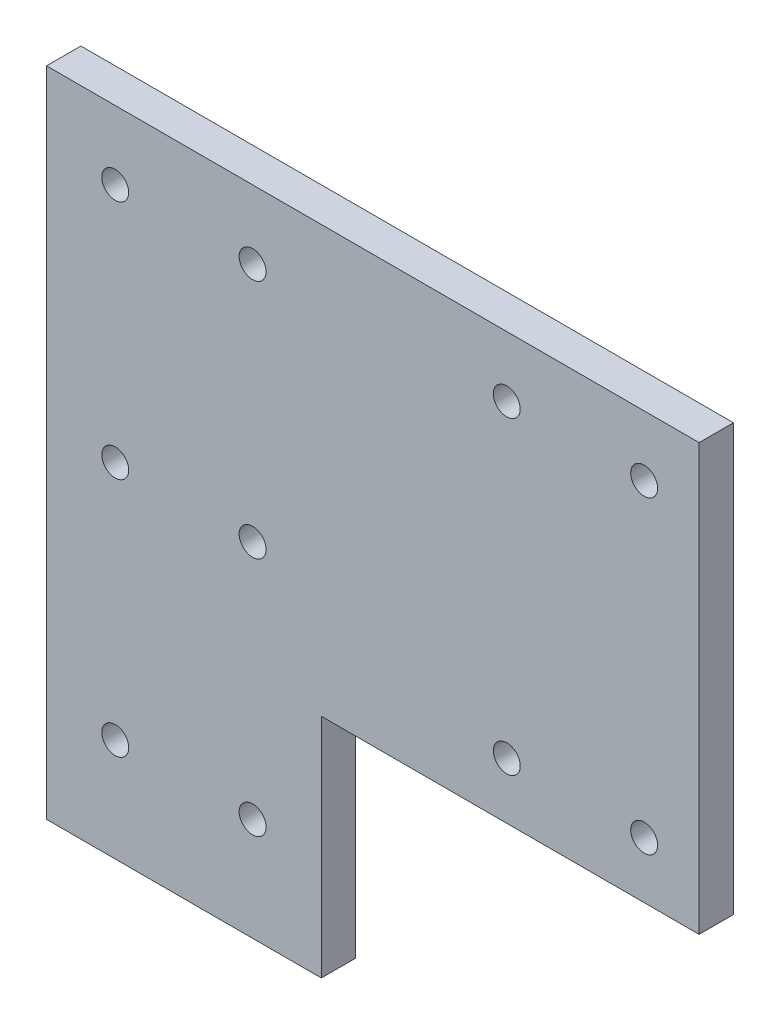
ISO-10303-21;
HEADER;
FILE_DESCRIPTION(('STEP AP214'),'2;1');
FILE_NAME('part.step','',(''),(''),'','','');
FILE_SCHEMA(('AUTOMOTIVE_DESIGN { 1 0 10303 214 1 1 1 1 }'));
ENDSEC;
DATA;
#1=APPLICATION_CONTEXT('core data for automotive mechanical design processes');
#2=APPLICATION_PROTOCOL_DEFINITION('international standard','automotive_design',2000,#1);
#3=PRODUCT_CONTEXT('',#1,'mechanical');
#4=PRODUCT('Part','Part','',(#3));
#5=PRODUCT_RELATED_PRODUCT_CATEGORY('part','',(#4));
#6=PRODUCT_DEFINITION_FORMATION('','',#4);
#7=PRODUCT_DEFINITION_CONTEXT('part definition',#1,'design');
#8=PRODUCT_DEFINITION('design','',#6,#7);
#9=PRODUCT_DEFINITION_SHAPE('','',#8);
#10=(LENGTH_UNIT() NAMED_UNIT(*) SI_UNIT(.MILLI.,.METRE.));
#11=(NAMED_UNIT(*) PLANE_ANGLE_UNIT() SI_UNIT($,.RADIAN.));
#12=(NAMED_UNIT(*) SI_UNIT($,.STERADIAN.) SOLID_ANGLE_UNIT());
#13=UNCERTAINTY_MEASURE_WITH_UNIT(LENGTH_MEASURE(1.E-05),#10,'distance_accuracy_value','');
#14=(GEOMETRIC_REPRESENTATION_CONTEXT(3) GLOBAL_UNCERTAINTY_ASSIGNED_CONTEXT((#13)) GLOBAL_UNIT_ASSIGNED_CONTEXT((#10,
#11,#12)) REPRESENTATION_CONTEXT('',''));
#15=CARTESIAN_POINT('',(0.,0.,0.));
#16=DIRECTION('',(0.,0.,1.));
#17=DIRECTION('',(1.,0.,0.));
#18=AXIS2_PLACEMENT_3D('',#15,#16,#17);
#19=CARTESIAN_POINT('',(50.8,0.,6.35));
#20=DIRECTION('',(0.,1.,0.));
#21=DIRECTION('',(-1.,0.,0.));
#22=AXIS2_PLACEMENT_3D('',#19,#20,#21);
#23=PLANE('',#22);
#24=DIRECTION('',(1.,0.,0.));
#25=VECTOR('',#24,1.);
#26=CARTESIAN_POINT('',(50.8,0.,0.));
#27=LINE('',#26,#25);
#28=CARTESIAN_POINT('',(0.,0.,0.));
#29=VERTEX_POINT('',#28);
#30=CARTESIAN_POINT('',(50.8,0.,0.));
#31=VERTEX_POINT('',#30);
#32=EDGE_CURVE('E116',#29,#31,#27,.T.);
#33=ORIENTED_EDGE('',*,*,#32,.T.);
#34=DIRECTION('',(0.,0.,-1.));
#35=VECTOR('',#34,1.);
#36=CARTESIAN_POINT('',(50.8,0.,6.35));
#37=LINE('',#36,#35);
#38=CARTESIAN_POINT('',(50.8,0.,6.35));
#39=VERTEX_POINT('',#38);
#40=EDGE_CURVE('E11',#39,#31,#37,.T.);
#41=ORIENTED_EDGE('',*,*,#40,.F.);
#42=DIRECTION('',(1.,0.,0.));
#43=VECTOR('',#42,1.);
#44=CARTESIAN_POINT('',(50.8,0.,6.35));
#45=LINE('',#44,#43);
#46=CARTESIAN_POINT('',(0.,0.,6.35));
#47=VERTEX_POINT('',#46);
#48=EDGE_CURVE('E127',#47,#39,#45,.T.);
#49=ORIENTED_EDGE('',*,*,#48,.F.);
#50=DIRECTION('',(0.,0.,-1.));
#51=VECTOR('',#50,1.);
#52=CARTESIAN_POINT('',(0.,0.,6.35));
#53=LINE('',#52,#51);
#54=EDGE_CURVE('E112',#47,#29,#53,.T.);
#55=ORIENTED_EDGE('',*,*,#54,.T.);
#56=EDGE_LOOP('',(#33,#41,#49,#55));
#57=FACE_BOUND('',#56,.T.);
#58=ADVANCED_FACE('F32',(#57),#23,.F.);
#59=CARTESIAN_POINT('',(50.8,41.91,6.35));
#60=DIRECTION('',(-1.,0.,0.));
#61=DIRECTION('',(0.,0.,1.));
#62=AXIS2_PLACEMENT_3D('',#59,#60,#61);
#63=PLANE('',#62);
#64=DIRECTION('',(0.,1.,0.));
#65=VECTOR('',#64,1.);
#66=CARTESIAN_POINT('',(50.8,41.91,0.));
#67=LINE('',#66,#65);
#68=CARTESIAN_POINT('',(50.8,41.91,0.));
#69=VERTEX_POINT('',#68);
#70=EDGE_CURVE('E119',#31,#69,#67,.T.);
#71=ORIENTED_EDGE('',*,*,#70,.T.);
#72=DIRECTION('',(0.,0.,-1.));
#73=VECTOR('',#72,1.);
#74=CARTESIAN_POINT('',(50.8,41.91,6.35));
#75=LINE('',#74,#73);
#76=CARTESIAN_POINT('',(50.8,41.91,6.35));
#77=VERTEX_POINT('',#76);
#78=EDGE_CURVE('E40',#77,#69,#75,.T.);
#79=ORIENTED_EDGE('',*,*,#78,.F.);
#80=DIRECTION('',(0.,1.,0.));
#81=VECTOR('',#80,1.);
#82=CARTESIAN_POINT('',(50.8,41.91,6.35));
#83=LINE('',#82,#81);
#84=EDGE_CURVE('E85',#39,#77,#83,.T.);
#85=ORIENTED_EDGE('',*,*,#84,.F.);
#86=ORIENTED_EDGE('',*,*,#40,.T.);
#87=EDGE_LOOP('',(#71,#79,#85,#86));
#88=FACE_BOUND('',#87,.T.);
#89=ADVANCED_FACE('F152',(#88),#63,.F.);
#90=CARTESIAN_POINT('',(120.65,41.91,6.35));
#91=DIRECTION('',(0.,1.,0.));
#92=DIRECTION('',(-1.,0.,0.));
#93=AXIS2_PLACEMENT_3D('',#90,#91,#92);
#94=PLANE('',#93);
#95=DIRECTION('',(1.,0.,0.));
#96=VECTOR('',#95,1.);
#97=CARTESIAN_POINT('',(120.65,41.91,0.));
#98=LINE('',#97,#96);
#99=CARTESIAN_POINT('',(120.65,41.91,0.));
#100=VERTEX_POINT('',#99);
#101=EDGE_CURVE('E122',#69,#100,#98,.T.);
#102=ORIENTED_EDGE('',*,*,#101,.T.);
#103=DIRECTION('',(0.,0.,-1.));
#104=VECTOR('',#103,1.);
#105=CARTESIAN_POINT('',(120.65,41.91,6.35));
#106=LINE('',#105,#104);
#107=CARTESIAN_POINT('',(120.65,41.91,6.35));
#108=VERTEX_POINT('',#107);
#109=EDGE_CURVE('E107',#108,#100,#106,.T.);
#110=ORIENTED_EDGE('',*,*,#109,.F.);
#111=DIRECTION('',(1.,0.,0.));
#112=VECTOR('',#111,1.);
#113=CARTESIAN_POINT('',(120.65,41.91,6.35));
#114=LINE('',#113,#112);
#115=EDGE_CURVE('E98',#77,#108,#114,.T.);
#116=ORIENTED_EDGE('',*,*,#115,.F.);
#117=ORIENTED_EDGE('',*,*,#78,.T.);
#118=EDGE_LOOP('',(#102,#110,#116,#117));
#119=FACE_BOUND('',#118,.T.);
#120=ADVANCED_FACE('F133',(#119),#94,.F.);
#121=CARTESIAN_POINT('',(120.65,120.65,6.35));
#122=DIRECTION('',(-1.,0.,0.));
#123=DIRECTION('',(0.,-1.,0.));
#124=AXIS2_PLACEMENT_3D('',#121,#122,#123);
#125=PLANE('',#124);
#126=DIRECTION('',(0.,1.,0.));
#127=VECTOR('',#126,1.);
#128=CARTESIAN_POINT('',(120.65,120.65,0.));
#129=LINE('',#128,#127);
#130=CARTESIAN_POINT('',(120.65,120.65,0.));
#131=VERTEX_POINT('',#130);
#132=EDGE_CURVE('E106',#100,#131,#129,.T.);
#133=ORIENTED_EDGE('',*,*,#132,.T.);
#134=DIRECTION('',(0.,0.,-1.));
#135=VECTOR('',#134,1.);
#136=CARTESIAN_POINT('',(120.65,120.65,6.35));
#137=LINE('',#136,#135);
#138=CARTESIAN_POINT('',(120.65,120.65,6.35));
#139=VERTEX_POINT('',#138);
#140=EDGE_CURVE('E103',#139,#131,#137,.T.);
#141=ORIENTED_EDGE('',*,*,#140,.F.);
#142=DIRECTION('',(0.,1.,0.));
#143=VECTOR('',#142,1.);
#144=CARTESIAN_POINT('',(120.65,120.65,6.35));
#145=LINE('',#144,#143);
#146=EDGE_CURVE('E92',#108,#139,#145,.T.);
#147=ORIENTED_EDGE('',*,*,#146,.F.);
#148=ORIENTED_EDGE('',*,*,#109,.T.);
#149=EDGE_LOOP('',(#133,#141,#147,#148));
#150=FACE_BOUND('',#149,.T.);
#151=ADVANCED_FACE('F104',(#150),#125,.F.);
#152=CARTESIAN_POINT('',(0.,120.65,6.35));
#153=DIRECTION('',(0.,-1.,0.));
#154=DIRECTION('',(0.,0.,-1.));
#155=AXIS2_PLACEMENT_3D('',#152,#153,#154);
#156=PLANE('',#155);
#157=DIRECTION('',(-1.,0.,0.));
#158=VECTOR('',#157,1.);
#159=CARTESIAN_POINT('',(0.,120.65,0.));
#160=LINE('',#159,#158);
#161=CARTESIAN_POINT('',(0.,120.65,0.));
#162=VERTEX_POINT('',#161);
#163=EDGE_CURVE('E71',#131,#162,#160,.T.);
#164=ORIENTED_EDGE('',*,*,#163,.T.);
#165=DIRECTION('',(0.,0.,-1.));
#166=VECTOR('',#165,1.);
#167=CARTESIAN_POINT('',(0.,120.65,6.35));
#168=LINE('',#167,#166);
#169=CARTESIAN_POINT('',(0.,120.65,6.35));
#170=VERTEX_POINT('',#169);
#171=EDGE_CURVE('E108',#170,#162,#168,.T.);
#172=ORIENTED_EDGE('',*,*,#171,.F.);
#173=DIRECTION('',(-1.,0.,0.));
#174=VECTOR('',#173,1.);
#175=CARTESIAN_POINT('',(0.,120.65,6.35));
#176=LINE('',#175,#174);
#177=EDGE_CURVE('E96',#139,#170,#176,.T.);
#178=ORIENTED_EDGE('',*,*,#177,.F.);
#179=ORIENTED_EDGE('',*,*,#140,.T.);
#180=EDGE_LOOP('',(#164,#172,#178,#179));
#181=FACE_BOUND('',#180,.T.);
#182=ADVANCED_FACE('F110',(#181),#156,.F.);
#183=CARTESIAN_POINT('',(0.,0.,6.35));
#184=DIRECTION('',(1.,0.,0.));
#185=DIRECTION('',(0.,0.,-1.));
#186=AXIS2_PLACEMENT_3D('',#183,#184,#185);
#187=PLANE('',#186);
#188=DIRECTION('',(0.,-1.,0.));
#189=VECTOR('',#188,1.);
#190=CARTESIAN_POINT('',(0.,0.,0.));
#191=LINE('',#190,#189);
#192=EDGE_CURVE('E77',#162,#29,#191,.T.);
#193=ORIENTED_EDGE('',*,*,#192,.T.);
#194=ORIENTED_EDGE('',*,*,#54,.F.);
#195=DIRECTION('',(0.,-1.,0.));
#196=VECTOR('',#195,1.);
#197=CARTESIAN_POINT('',(0.,0.,6.35));
#198=LINE('',#197,#196);
#199=EDGE_CURVE('E48',#170,#47,#198,.T.);
#200=ORIENTED_EDGE('',*,*,#199,.F.);
#201=ORIENTED_EDGE('',*,*,#171,.T.);
#202=EDGE_LOOP('',(#193,#194,#200,#201));
#203=FACE_BOUND('',#202,.T.);
#204=ADVANCED_FACE('F140',(#203),#187,.F.);
#205=CARTESIAN_POINT('',(0.,0.,6.35));
#206=DIRECTION('',(0.,0.,-1.));
#207=DIRECTION('',(-1.,0.,0.));
#208=AXIS2_PLACEMENT_3D('',#205,#206,#207);
#209=PLANE('',#208);
#210=CARTESIAN_POINT('',(38.1,63.5,6.35));
#211=DIRECTION('',(0.,0.,-1.));
#212=DIRECTION('',(-1.,0.,0.));
#213=AXIS2_PLACEMENT_3D('',#210,#211,#212);
#214=CIRCLE('',#213,2.4892);
#215=CARTESIAN_POINT('',(35.6108,63.5,6.35));
#216=VERTEX_POINT('',#215);
#217=EDGE_CURVE('E295',#216,#216,#214,.T.);
#218=ORIENTED_EDGE('',*,*,#217,.T.);
#219=EDGE_LOOP('',(#218));
#220=FACE_BOUND('',#219,.T.);
#221=CARTESIAN_POINT('',(38.1,19.05,6.35));
#222=DIRECTION('',(0.,0.,-1.));
#223=DIRECTION('',(-1.,0.,0.));
#224=AXIS2_PLACEMENT_3D('',#221,#222,#223);
#225=CIRCLE('',#224,2.4892);
#226=CARTESIAN_POINT('',(35.6108,19.05,6.35));
#227=VERTEX_POINT('',#226);
#228=EDGE_CURVE('E368',#227,#227,#225,.T.);
#229=ORIENTED_EDGE('',*,*,#228,.T.);
#230=EDGE_LOOP('',(#229));
#231=FACE_BOUND('',#230,.T.);
#232=CARTESIAN_POINT('',(12.7,19.05,6.35));
#233=DIRECTION('',(0.,0.,-1.));
#234=DIRECTION('',(-1.,0.,0.));
#235=AXIS2_PLACEMENT_3D('',#232,#233,#234);
#236=CIRCLE('',#235,2.4892);
#237=CARTESIAN_POINT('',(10.2108,19.05,6.35));
#238=VERTEX_POINT('',#237);
#239=EDGE_CURVE('E362',#238,#238,#236,.T.);
#240=ORIENTED_EDGE('',*,*,#239,.T.);
#241=EDGE_LOOP('',(#240));
#242=FACE_BOUND('',#241,.T.);
#243=CARTESIAN_POINT('',(12.7,107.95,6.35));
#244=DIRECTION('',(0.,0.,-1.));
#245=DIRECTION('',(-1.,0.,0.));
#246=AXIS2_PLACEMENT_3D('',#243,#244,#245);
#247=CIRCLE('',#246,2.48919999999999);
#248=CARTESIAN_POINT('',(10.2108,107.95,6.35));
#249=VERTEX_POINT('',#248);
#250=EDGE_CURVE('E321',#249,#249,#247,.T.);
#251=ORIENTED_EDGE('',*,*,#250,.T.);
#252=EDGE_LOOP('',(#251));
#253=FACE_BOUND('',#252,.T.);
#254=CARTESIAN_POINT('',(85.09,52.324,6.35));
#255=DIRECTION('',(0.,0.,-1.));
#256=DIRECTION('',(-1.,0.,0.));
#257=AXIS2_PLACEMENT_3D('',#254,#255,#256);
#258=CIRCLE('',#257,2.4892);
#259=CARTESIAN_POINT('',(82.6008,52.324,6.35));
#260=VERTEX_POINT('',#259);
#261=EDGE_CURVE('E322',#260,#260,#258,.T.);
#262=ORIENTED_EDGE('',*,*,#261,.T.);
#263=EDGE_LOOP('',(#262));
#264=FACE_BOUND('',#263,.T.);
#265=CARTESIAN_POINT('',(110.49,109.474,6.35));
#266=DIRECTION('',(0.,0.,-1.));
#267=DIRECTION('',(-1.,0.,0.));
#268=AXIS2_PLACEMENT_3D('',#265,#266,#267);
#269=CIRCLE('',#268,2.4892);
#270=CARTESIAN_POINT('',(108.0008,109.474,6.35));
#271=VERTEX_POINT('',#270);
#272=EDGE_CURVE('E329',#271,#271,#269,.T.);
#273=ORIENTED_EDGE('',*,*,#272,.T.);
#274=EDGE_LOOP('',(#273));
#275=FACE_BOUND('',#274,.T.);
#276=CARTESIAN_POINT('',(110.49,52.324,6.35));
#277=DIRECTION('',(0.,0.,-1.));
#278=DIRECTION('',(-1.,0.,0.));
#279=AXIS2_PLACEMENT_3D('',#276,#277,#278);
#280=CIRCLE('',#279,2.48920000000002);
#281=CARTESIAN_POINT('',(108.0008,52.324,6.35));
#282=VERTEX_POINT('',#281);
#283=EDGE_CURVE('E308',#282,#282,#280,.T.);
#284=ORIENTED_EDGE('',*,*,#283,.T.);
#285=EDGE_LOOP('',(#284));
#286=FACE_BOUND('',#285,.T.);
#287=CARTESIAN_POINT('',(38.1,107.95,6.35));
#288=DIRECTION('',(0.,0.,-1.));
#289=DIRECTION('',(-1.,0.,0.));
#290=AXIS2_PLACEMENT_3D('',#287,#288,#289);
#291=CIRCLE('',#290,2.4892);
#292=CARTESIAN_POINT('',(35.6108,107.95,6.35));
#293=VERTEX_POINT('',#292);
#294=EDGE_CURVE('E315',#293,#293,#291,.T.);
#295=ORIENTED_EDGE('',*,*,#294,.T.);
#296=EDGE_LOOP('',(#295));
#297=FACE_BOUND('',#296,.T.);
#298=CARTESIAN_POINT('',(12.7,63.5,6.35));
#299=DIRECTION('',(0.,0.,-1.));
#300=DIRECTION('',(-1.,0.,0.));
#301=AXIS2_PLACEMENT_3D('',#298,#299,#300);
#302=CIRCLE('',#301,2.48919999999999);
#303=CARTESIAN_POINT('',(10.2108,63.5,6.35));
#304=VERTEX_POINT('',#303);
#305=EDGE_CURVE('E299',#304,#304,#302,.T.);
#306=ORIENTED_EDGE('',*,*,#305,.T.);
#307=EDGE_LOOP('',(#306));
#308=FACE_BOUND('',#307,.T.);
#309=CARTESIAN_POINT('',(85.09,109.474,6.35));
#310=DIRECTION('',(0.,0.,-1.));
#311=DIRECTION('',(-1.,0.,0.));
#312=AXIS2_PLACEMENT_3D('',#309,#310,#311);
#313=CIRCLE('',#312,2.4892);
#314=CARTESIAN_POINT('',(82.6008,109.474,6.35));
#315=VERTEX_POINT('',#314);
#316=EDGE_CURVE('E120',#315,#315,#313,.T.);
#317=ORIENTED_EDGE('',*,*,#316,.T.);
#318=EDGE_LOOP('',(#317));
#319=FACE_BOUND('',#318,.T.);
#320=ORIENTED_EDGE('',*,*,#48,.T.);
#321=ORIENTED_EDGE('',*,*,#84,.T.);
#322=ORIENTED_EDGE('',*,*,#115,.T.);
#323=ORIENTED_EDGE('',*,*,#146,.T.);
#324=ORIENTED_EDGE('',*,*,#177,.T.);
#325=ORIENTED_EDGE('',*,*,#199,.T.);
#326=EDGE_LOOP('',(#320,#321,#322,#323,#324,#325));
#327=FACE_BOUND('',#326,.T.);
#328=ADVANCED_FACE('F94',(#220,#231,#242,#253,#264,#275,#286,#297,#308,#319,#327),#209,.F.);
#329=CARTESIAN_POINT('',(0.,0.,0.));
#330=DIRECTION('',(0.,0.,-1.));
#331=DIRECTION('',(-1.,0.,0.));
#332=AXIS2_PLACEMENT_3D('',#329,#330,#331);
#333=PLANE('',#332);
#334=CARTESIAN_POINT('',(38.1,63.5,0.));
#335=DIRECTION('',(0.,0.,-1.));
#336=DIRECTION('',(-1.,0.,0.));
#337=AXIS2_PLACEMENT_3D('',#334,#335,#336);
#338=CIRCLE('',#337,2.4892);
#339=CARTESIAN_POINT('',(35.6108,63.5,0.));
#340=VERTEX_POINT('',#339);
#341=EDGE_CURVE('E298',#340,#340,#338,.T.);
#342=ORIENTED_EDGE('',*,*,#341,.F.);
#343=EDGE_LOOP('',(#342));
#344=FACE_BOUND('',#343,.T.);
#345=CARTESIAN_POINT('',(38.1,19.05,0.));
#346=DIRECTION('',(0.,0.,-1.));
#347=DIRECTION('',(-1.,0.,0.));
#348=AXIS2_PLACEMENT_3D('',#345,#346,#347);
#349=CIRCLE('',#348,2.4892);
#350=CARTESIAN_POINT('',(35.6108,19.05,0.));
#351=VERTEX_POINT('',#350);
#352=EDGE_CURVE('E301',#351,#351,#349,.T.);
#353=ORIENTED_EDGE('',*,*,#352,.F.);
#354=EDGE_LOOP('',(#353));
#355=FACE_BOUND('',#354,.T.);
#356=CARTESIAN_POINT('',(12.7,19.05,0.));
#357=DIRECTION('',(0.,0.,-1.));
#358=DIRECTION('',(-1.,0.,0.));
#359=AXIS2_PLACEMENT_3D('',#356,#357,#358);
#360=CIRCLE('',#359,2.4892);
#361=CARTESIAN_POINT('',(10.2108,19.05,0.));
#362=VERTEX_POINT('',#361);
#363=EDGE_CURVE('E365',#362,#362,#360,.T.);
#364=ORIENTED_EDGE('',*,*,#363,.F.);
#365=EDGE_LOOP('',(#364));
#366=FACE_BOUND('',#365,.T.);
#367=CARTESIAN_POINT('',(12.7,107.95,0.));
#368=DIRECTION('',(0.,0.,-1.));
#369=DIRECTION('',(-1.,0.,0.));
#370=AXIS2_PLACEMENT_3D('',#367,#368,#369);
#371=CIRCLE('',#370,2.48919999999999);
#372=CARTESIAN_POINT('',(10.2108,107.95,0.));
#373=VERTEX_POINT('',#372);
#374=EDGE_CURVE('E359',#373,#373,#371,.T.);
#375=ORIENTED_EDGE('',*,*,#374,.F.);
#376=EDGE_LOOP('',(#375));
#377=FACE_BOUND('',#376,.T.);
#378=CARTESIAN_POINT('',(85.09,52.324,0.));
#379=DIRECTION('',(0.,0.,-1.));
#380=DIRECTION('',(-1.,0.,0.));
#381=AXIS2_PLACEMENT_3D('',#378,#379,#380);
#382=CIRCLE('',#381,2.4892);
#383=CARTESIAN_POINT('',(82.6008,52.324,0.));
#384=VERTEX_POINT('',#383);
#385=EDGE_CURVE('E326',#384,#384,#382,.T.);
#386=ORIENTED_EDGE('',*,*,#385,.F.);
#387=EDGE_LOOP('',(#386));
#388=FACE_BOUND('',#387,.T.);
#389=CARTESIAN_POINT('',(110.49,109.474,0.));
#390=DIRECTION('',(0.,0.,-1.));
#391=DIRECTION('',(-1.,0.,0.));
#392=AXIS2_PLACEMENT_3D('',#389,#390,#391);
#393=CIRCLE('',#392,2.4892);
#394=CARTESIAN_POINT('',(108.0008,109.474,0.));
#395=VERTEX_POINT('',#394);
#396=EDGE_CURVE('E311',#395,#395,#393,.T.);
#397=ORIENTED_EDGE('',*,*,#396,.F.);
#398=EDGE_LOOP('',(#397));
#399=FACE_BOUND('',#398,.T.);
#400=CARTESIAN_POINT('',(110.49,52.324,0.));
#401=DIRECTION('',(0.,0.,-1.));
#402=DIRECTION('',(-1.,0.,0.));
#403=AXIS2_PLACEMENT_3D('',#400,#401,#402);
#404=CIRCLE('',#403,2.48920000000002);
#405=CARTESIAN_POINT('',(108.0008,52.324,0.));
#406=VERTEX_POINT('',#405);
#407=EDGE_CURVE('E312',#406,#406,#404,.T.);
#408=ORIENTED_EDGE('',*,*,#407,.F.);
#409=EDGE_LOOP('',(#408));
#410=FACE_BOUND('',#409,.T.);
#411=CARTESIAN_POINT('',(38.1,107.95,0.));
#412=DIRECTION('',(0.,0.,-1.));
#413=DIRECTION('',(-1.,0.,0.));
#414=AXIS2_PLACEMENT_3D('',#411,#412,#413);
#415=CIRCLE('',#414,2.4892);
#416=CARTESIAN_POINT('',(35.6108,107.95,0.));
#417=VERTEX_POINT('',#416);
#418=EDGE_CURVE('E318',#417,#417,#415,.T.);
#419=ORIENTED_EDGE('',*,*,#418,.F.);
#420=EDGE_LOOP('',(#419));
#421=FACE_BOUND('',#420,.T.);
#422=CARTESIAN_POINT('',(12.7,63.5,0.));
#423=DIRECTION('',(0.,0.,-1.));
#424=DIRECTION('',(-1.,0.,0.));
#425=AXIS2_PLACEMENT_3D('',#422,#423,#424);
#426=CIRCLE('',#425,2.48919999999999);
#427=CARTESIAN_POINT('',(10.2108,63.5,0.));
#428=VERTEX_POINT('',#427);
#429=EDGE_CURVE('E304',#428,#428,#426,.T.);
#430=ORIENTED_EDGE('',*,*,#429,.F.);
#431=EDGE_LOOP('',(#430));
#432=FACE_BOUND('',#431,.T.);
#433=CARTESIAN_POINT('',(85.09,109.474,0.));
#434=DIRECTION('',(0.,0.,-1.));
#435=DIRECTION('',(-1.,0.,0.));
#436=AXIS2_PLACEMENT_3D('',#433,#434,#435);
#437=CIRCLE('',#436,2.4892);
#438=CARTESIAN_POINT('',(82.6008,109.474,0.));
#439=VERTEX_POINT('',#438);
#440=EDGE_CURVE('E325',#439,#439,#437,.T.);
#441=ORIENTED_EDGE('',*,*,#440,.F.);
#442=EDGE_LOOP('',(#441));
#443=FACE_BOUND('',#442,.T.);
#444=ORIENTED_EDGE('',*,*,#32,.F.);
#445=ORIENTED_EDGE('',*,*,#192,.F.);
#446=ORIENTED_EDGE('',*,*,#163,.F.);
#447=ORIENTED_EDGE('',*,*,#132,.F.);
#448=ORIENTED_EDGE('',*,*,#101,.F.);
#449=ORIENTED_EDGE('',*,*,#70,.F.);
#450=EDGE_LOOP('',(#444,#445,#446,#447,#448,#449));
#451=FACE_BOUND('',#450,.T.);
#452=ADVANCED_FACE('F136',(#344,#355,#366,#377,#388,#399,#410,#421,#432,#443,#451),#333,.T.);
#453=CARTESIAN_POINT('',(85.09,109.474,6.35));
#454=DIRECTION('',(0.,0.,-1.));
#455=DIRECTION('',(-1.,0.,0.));
#456=AXIS2_PLACEMENT_3D('',#453,#454,#455);
#457=CYLINDRICAL_SURFACE('',#456,2.4892);
#458=ORIENTED_EDGE('',*,*,#316,.F.);
#459=EDGE_LOOP('',(#458));
#460=FACE_BOUND('',#459,.T.);
#461=ORIENTED_EDGE('',*,*,#440,.T.);
#462=EDGE_LOOP('',(#461));
#463=FACE_BOUND('',#462,.T.);
#464=ADVANCED_FACE('F189',(#460,#463),#457,.F.);
#465=CARTESIAN_POINT('',(12.7,63.5,6.35));
#466=DIRECTION('',(0.,0.,-1.));
#467=DIRECTION('',(-1.,0.,0.));
#468=AXIS2_PLACEMENT_3D('',#465,#466,#467);
#469=CYLINDRICAL_SURFACE('',#468,2.48919999999999);
#470=ORIENTED_EDGE('',*,*,#305,.F.);
#471=EDGE_LOOP('',(#470));
#472=FACE_BOUND('',#471,.T.);
#473=ORIENTED_EDGE('',*,*,#429,.T.);
#474=EDGE_LOOP('',(#473));
#475=FACE_BOUND('',#474,.T.);
#476=ADVANCED_FACE('F198',(#472,#475),#469,.F.);
#477=CARTESIAN_POINT('',(38.1,107.95,6.35));
#478=DIRECTION('',(0.,0.,-1.));
#479=DIRECTION('',(-1.,0.,0.));
#480=AXIS2_PLACEMENT_3D('',#477,#478,#479);
#481=CYLINDRICAL_SURFACE('',#480,2.4892);
#482=ORIENTED_EDGE('',*,*,#294,.F.);
#483=EDGE_LOOP('',(#482));
#484=FACE_BOUND('',#483,.T.);
#485=ORIENTED_EDGE('',*,*,#418,.T.);
#486=EDGE_LOOP('',(#485));
#487=FACE_BOUND('',#486,.T.);
#488=ADVANCED_FACE('F208',(#484,#487),#481,.F.);
#489=CARTESIAN_POINT('',(110.49,52.324,6.35));
#490=DIRECTION('',(0.,0.,-1.));
#491=DIRECTION('',(-1.,0.,0.));
#492=AXIS2_PLACEMENT_3D('',#489,#490,#491);
#493=CYLINDRICAL_SURFACE('',#492,2.48920000000002);
#494=ORIENTED_EDGE('',*,*,#283,.F.);
#495=EDGE_LOOP('',(#494));
#496=FACE_BOUND('',#495,.T.);
#497=ORIENTED_EDGE('',*,*,#407,.T.);
#498=EDGE_LOOP('',(#497));
#499=FACE_BOUND('',#498,.T.);
#500=ADVANCED_FACE('F218',(#496,#499),#493,.F.);
#501=CARTESIAN_POINT('',(110.49,109.474,6.35));
#502=DIRECTION('',(0.,0.,-1.));
#503=DIRECTION('',(-1.,0.,0.));
#504=AXIS2_PLACEMENT_3D('',#501,#502,#503);
#505=CYLINDRICAL_SURFACE('',#504,2.4892);
#506=ORIENTED_EDGE('',*,*,#272,.F.);
#507=EDGE_LOOP('',(#506));
#508=FACE_BOUND('',#507,.T.);
#509=ORIENTED_EDGE('',*,*,#396,.T.);
#510=EDGE_LOOP('',(#509));
#511=FACE_BOUND('',#510,.T.);
#512=ADVANCED_FACE('F228',(#508,#511),#505,.F.);
#513=CARTESIAN_POINT('',(85.09,52.324,6.35));
#514=DIRECTION('',(0.,0.,-1.));
#515=DIRECTION('',(-1.,0.,0.));
#516=AXIS2_PLACEMENT_3D('',#513,#514,#515);
#517=CYLINDRICAL_SURFACE('',#516,2.4892);
#518=ORIENTED_EDGE('',*,*,#261,.F.);
#519=EDGE_LOOP('',(#518));
#520=FACE_BOUND('',#519,.T.);
#521=ORIENTED_EDGE('',*,*,#385,.T.);
#522=EDGE_LOOP('',(#521));
#523=FACE_BOUND('',#522,.T.);
#524=ADVANCED_FACE('F238',(#520,#523),#517,.F.);
#525=CARTESIAN_POINT('',(12.7,107.95,6.35));
#526=DIRECTION('',(0.,0.,-1.));
#527=DIRECTION('',(-1.,0.,0.));
#528=AXIS2_PLACEMENT_3D('',#525,#526,#527);
#529=CYLINDRICAL_SURFACE('',#528,2.48919999999999);
#530=ORIENTED_EDGE('',*,*,#250,.F.);
#531=EDGE_LOOP('',(#530));
#532=FACE_BOUND('',#531,.T.);
#533=ORIENTED_EDGE('',*,*,#374,.T.);
#534=EDGE_LOOP('',(#533));
#535=FACE_BOUND('',#534,.T.);
#536=ADVANCED_FACE('F248',(#532,#535),#529,.F.);
#537=CARTESIAN_POINT('',(12.7,19.05,6.35));
#538=DIRECTION('',(0.,0.,-1.));
#539=DIRECTION('',(-1.,0.,0.));
#540=AXIS2_PLACEMENT_3D('',#537,#538,#539);
#541=CYLINDRICAL_SURFACE('',#540,2.4892);
#542=ORIENTED_EDGE('',*,*,#239,.F.);
#543=EDGE_LOOP('',(#542));
#544=FACE_BOUND('',#543,.T.);
#545=ORIENTED_EDGE('',*,*,#363,.T.);
#546=EDGE_LOOP('',(#545));
#547=FACE_BOUND('',#546,.T.);
#548=ADVANCED_FACE('F258',(#544,#547),#541,.F.);
#549=CARTESIAN_POINT('',(38.1,19.05,6.35));
#550=DIRECTION('',(0.,0.,-1.));
#551=DIRECTION('',(-1.,0.,0.));
#552=AXIS2_PLACEMENT_3D('',#549,#550,#551);
#553=CYLINDRICAL_SURFACE('',#552,2.4892);
#554=ORIENTED_EDGE('',*,*,#228,.F.);
#555=EDGE_LOOP('',(#554));
#556=FACE_BOUND('',#555,.T.);
#557=ORIENTED_EDGE('',*,*,#352,.T.);
#558=EDGE_LOOP('',(#557));
#559=FACE_BOUND('',#558,.T.);
#560=ADVANCED_FACE('F268',(#556,#559),#553,.F.);
#561=CARTESIAN_POINT('',(38.1,63.5,6.35));
#562=DIRECTION('',(0.,0.,-1.));
#563=DIRECTION('',(-1.,0.,0.));
#564=AXIS2_PLACEMENT_3D('',#561,#562,#563);
#565=CYLINDRICAL_SURFACE('',#564,2.4892);
#566=ORIENTED_EDGE('',*,*,#217,.F.);
#567=EDGE_LOOP('',(#566));
#568=FACE_BOUND('',#567,.T.);
#569=ORIENTED_EDGE('',*,*,#341,.T.);
#570=EDGE_LOOP('',(#569));
#571=FACE_BOUND('',#570,.T.);
#572=ADVANCED_FACE('F278',(#568,#571),#565,.F.);
#573=CLOSED_SHELL('',(#58,#89,#120,#151,#182,#204,#328,#452,#464,#476,#488,#500,#512,#524,#536,
#548,#560,#572));
#574=MANIFOLD_SOLID_BREP('B2',#573);
#575=ADVANCED_BREP_SHAPE_REPRESENTATION('',(#18,#574),#14);
#576=SHAPE_DEFINITION_REPRESENTATION(#9,#575);
ENDSEC;
END-ISO-10303-21;
